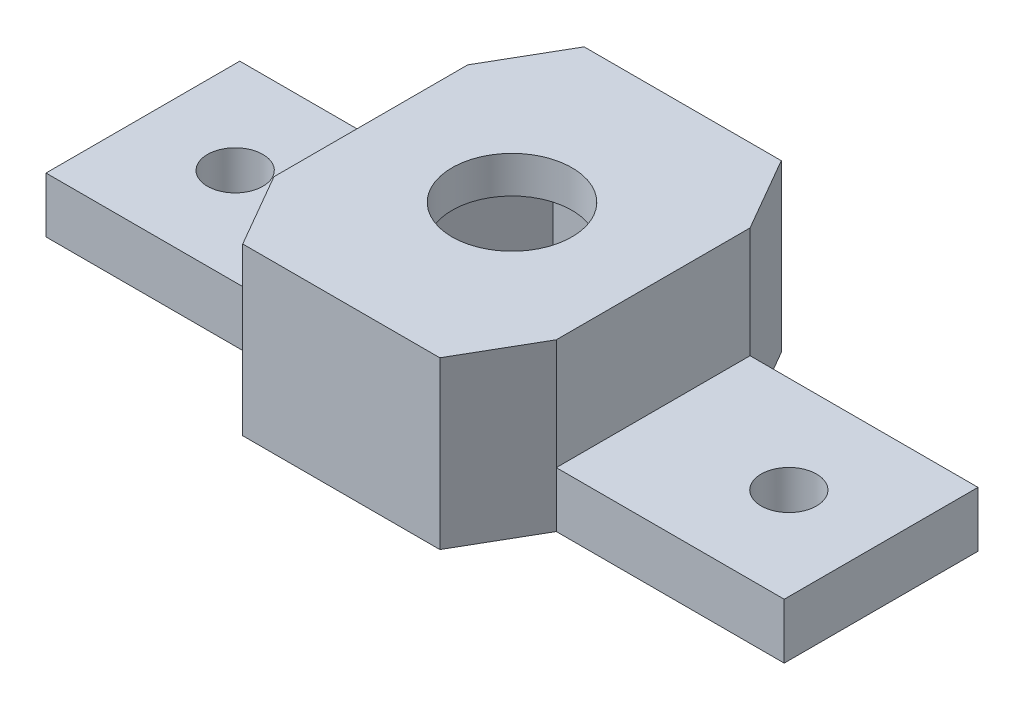
ISO-10303-21;
HEADER;
FILE_DESCRIPTION(('STEP AP214'),'2;1');
FILE_NAME('part.step','',(''),(''),'','','');
FILE_SCHEMA(('AUTOMOTIVE_DESIGN { 1 0 10303 214 1 1 1 1 }'));
ENDSEC;
DATA;
#1=APPLICATION_CONTEXT('core data for automotive mechanical design processes');
#2=APPLICATION_PROTOCOL_DEFINITION('international standard','automotive_design',2000,#1);
#3=PRODUCT_CONTEXT('',#1,'mechanical');
#4=PRODUCT('Part','Part','',(#3));
#5=PRODUCT_RELATED_PRODUCT_CATEGORY('part','',(#4));
#6=PRODUCT_DEFINITION_FORMATION('','',#4);
#7=PRODUCT_DEFINITION_CONTEXT('part definition',#1,'design');
#8=PRODUCT_DEFINITION('design','',#6,#7);
#9=PRODUCT_DEFINITION_SHAPE('','',#8);
#10=(LENGTH_UNIT() NAMED_UNIT(*) SI_UNIT(.MILLI.,.METRE.));
#11=(NAMED_UNIT(*) PLANE_ANGLE_UNIT() SI_UNIT($,.RADIAN.));
#12=(NAMED_UNIT(*) SI_UNIT($,.STERADIAN.) SOLID_ANGLE_UNIT());
#13=UNCERTAINTY_MEASURE_WITH_UNIT(LENGTH_MEASURE(1.E-05),#10,'distance_accuracy_value','');
#14=(GEOMETRIC_REPRESENTATION_CONTEXT(3) GLOBAL_UNCERTAINTY_ASSIGNED_CONTEXT((#13)) GLOBAL_UNIT_ASSIGNED_CONTEXT((#10,
#11,#12)) REPRESENTATION_CONTEXT('',''));
#15=CARTESIAN_POINT('',(0.,0.,0.));
#16=DIRECTION('',(0.,0.,1.));
#17=DIRECTION('',(1.,0.,0.));
#18=AXIS2_PLACEMENT_3D('',#15,#16,#17);
#19=CARTESIAN_POINT('',(5.34048999000404,0.,-9.25));
#20=DIRECTION('',(0.,1.,0.));
#21=DIRECTION('',(0.,0.,1.));
#22=AXIS2_PLACEMENT_3D('',#19,#20,#21);
#23=PLANE('',#22);
#24=CARTESIAN_POINT('',(-15.,0.,0.));
#25=DIRECTION('',(0.,1.,0.));
#26=DIRECTION('',(0.,0.,1.));
#27=AXIS2_PLACEMENT_3D('',#24,#25,#26);
#28=CIRCLE('',#27,1.5);
#29=CARTESIAN_POINT('',(-15.,0.,1.5));
#30=VERTEX_POINT('',#29);
#31=EDGE_CURVE('E242',#30,#30,#28,.T.);
#32=ORIENTED_EDGE('',*,*,#31,.T.);
#33=EDGE_LOOP('',(#32));
#34=FACE_BOUND('',#33,.T.);
#35=DIRECTION('',(-0.499999999999999,0.,-0.866025403784439));
#36=VECTOR('',#35,1.);
#37=CARTESIAN_POINT('',(7.64989106676253,0.,-5.25));
#38=LINE('',#37,#36);
#39=CARTESIAN_POINT('',(7.64989106676253,0.,-5.25));
#40=VERTEX_POINT('',#39);
#41=CARTESIAN_POINT('',(5.34048999000404,0.,-9.25));
#42=VERTEX_POINT('',#41);
#43=EDGE_CURVE('E295',#40,#42,#38,.T.);
#44=ORIENTED_EDGE('',*,*,#43,.F.);
#45=DIRECTION('',(-1.,0.,0.));
#46=VECTOR('',#45,1.);
#47=CARTESIAN_POINT('',(7.64989106676253,0.,-5.25));
#48=LINE('',#47,#46);
#49=CARTESIAN_POINT('',(20.,0.,-5.25));
#50=VERTEX_POINT('',#49);
#51=EDGE_CURVE('E324',#50,#40,#48,.T.);
#52=ORIENTED_EDGE('',*,*,#51,.F.);
#53=DIRECTION('',(0.,0.,-1.));
#54=VECTOR('',#53,1.);
#55=CARTESIAN_POINT('',(20.,0.,-5.25));
#56=LINE('',#55,#54);
#57=CARTESIAN_POINT('',(20.,0.,5.25));
#58=VERTEX_POINT('',#57);
#59=EDGE_CURVE('E321',#58,#50,#56,.T.);
#60=ORIENTED_EDGE('',*,*,#59,.F.);
#61=DIRECTION('',(1.,0.,0.));
#62=VECTOR('',#61,1.);
#63=CARTESIAN_POINT('',(20.,0.,5.25));
#64=LINE('',#63,#62);
#65=CARTESIAN_POINT('',(7.64989106676253,0.,5.25));
#66=VERTEX_POINT('',#65);
#67=EDGE_CURVE('E318',#66,#58,#64,.T.);
#68=ORIENTED_EDGE('',*,*,#67,.F.);
#69=DIRECTION('',(0.5,0.,-0.866025403784439));
#70=VECTOR('',#69,1.);
#71=CARTESIAN_POINT('',(5.34048999000403,0.,9.25));
#72=LINE('',#71,#70);
#73=CARTESIAN_POINT('',(5.34048999000403,0.,9.25));
#74=VERTEX_POINT('',#73);
#75=EDGE_CURVE('E315',#74,#66,#72,.T.);
#76=ORIENTED_EDGE('',*,*,#75,.F.);
#77=DIRECTION('',(1.,0.,0.));
#78=VECTOR('',#77,1.);
#79=CARTESIAN_POINT('',(-5.34048999000405,0.,9.25));
#80=LINE('',#79,#78);
#81=CARTESIAN_POINT('',(-5.34048999000405,0.,9.25));
#82=VERTEX_POINT('',#81);
#83=EDGE_CURVE('E313',#82,#74,#80,.T.);
#84=ORIENTED_EDGE('',*,*,#83,.F.);
#85=DIRECTION('',(0.5,0.,0.866025403784439));
#86=VECTOR('',#85,1.);
#87=CARTESIAN_POINT('',(-7.64989106676255,0.,5.25));
#88=LINE('',#87,#86);
#89=CARTESIAN_POINT('',(-7.64989106676255,0.,5.25));
#90=VERTEX_POINT('',#89);
#91=EDGE_CURVE('E177',#90,#82,#88,.T.);
#92=ORIENTED_EDGE('',*,*,#91,.F.);
#93=DIRECTION('',(1.,0.,0.));
#94=VECTOR('',#93,1.);
#95=CARTESIAN_POINT('',(-20.,0.,5.25));
#96=LINE('',#95,#94);
#97=CARTESIAN_POINT('',(-20.,0.,5.25));
#98=VERTEX_POINT('',#97);
#99=EDGE_CURVE('E309',#98,#90,#96,.T.);
#100=ORIENTED_EDGE('',*,*,#99,.F.);
#101=DIRECTION('',(0.,0.,1.));
#102=VECTOR('',#101,1.);
#103=CARTESIAN_POINT('',(-20.,0.,-5.25));
#104=LINE('',#103,#102);
#105=CARTESIAN_POINT('',(-20.,0.,-5.25));
#106=VERTEX_POINT('',#105);
#107=EDGE_CURVE('E306',#106,#98,#104,.T.);
#108=ORIENTED_EDGE('',*,*,#107,.F.);
#109=DIRECTION('',(-1.,0.,0.));
#110=VECTOR('',#109,1.);
#111=CARTESIAN_POINT('',(-7.64989106676255,0.,-5.25));
#112=LINE('',#111,#110);
#113=CARTESIAN_POINT('',(-7.64989106676255,0.,-5.25));
#114=VERTEX_POINT('',#113);
#115=EDGE_CURVE('E303',#114,#106,#112,.T.);
#116=ORIENTED_EDGE('',*,*,#115,.F.);
#117=DIRECTION('',(-0.499999999999999,0.,0.866025403784439));
#118=VECTOR('',#117,1.);
#119=CARTESIAN_POINT('',(-5.34048999000406,0.,-9.25));
#120=LINE('',#119,#118);
#121=CARTESIAN_POINT('',(-5.34048999000406,0.,-9.25));
#122=VERTEX_POINT('',#121);
#123=EDGE_CURVE('E300',#122,#114,#120,.T.);
#124=ORIENTED_EDGE('',*,*,#123,.F.);
#125=DIRECTION('',(-1.,0.,0.));
#126=VECTOR('',#125,1.);
#127=CARTESIAN_POINT('',(5.34048999000404,0.,-9.25));
#128=LINE('',#127,#126);
#129=EDGE_CURVE('E298',#42,#122,#128,.T.);
#130=ORIENTED_EDGE('',*,*,#129,.F.);
#131=EDGE_LOOP('',(#44,#52,#60,#68,#76,#84,#92,#100,#108,#116,#124,#130));
#132=FACE_BOUND('',#131,.T.);
#133=DIRECTION('',(0.5,0.,-0.866025403784439));
#134=VECTOR('',#133,1.);
#135=CARTESIAN_POINT('',(3.03108891324553,0.,5.25));
#136=LINE('',#135,#134);
#137=CARTESIAN_POINT('',(3.03108891324553,0.,5.25));
#138=VERTEX_POINT('',#137);
#139=CARTESIAN_POINT('',(6.06217782649106,0.,0.));
#140=VERTEX_POINT('',#139);
#141=EDGE_CURVE('E245',#138,#140,#136,.T.);
#142=ORIENTED_EDGE('',*,*,#141,.T.);
#143=DIRECTION('',(-0.5,0.,-0.866025403784438));
#144=VECTOR('',#143,1.);
#145=CARTESIAN_POINT('',(6.06217782649106,0.,0.));
#146=LINE('',#145,#144);
#147=CARTESIAN_POINT('',(3.03108891324553,0.,-5.25));
#148=VERTEX_POINT('',#147);
#149=EDGE_CURVE('E268',#140,#148,#146,.T.);
#150=ORIENTED_EDGE('',*,*,#149,.T.);
#151=DIRECTION('',(-1.,0.,0.));
#152=VECTOR('',#151,1.);
#153=CARTESIAN_POINT('',(3.03108891324553,0.,-5.25));
#154=LINE('',#153,#152);
#155=CARTESIAN_POINT('',(-3.03108891324555,0.,-5.25));
#156=VERTEX_POINT('',#155);
#157=EDGE_CURVE('E271',#148,#156,#154,.T.);
#158=ORIENTED_EDGE('',*,*,#157,.T.);
#159=DIRECTION('',(-0.5,0.,0.866025403784439));
#160=VECTOR('',#159,1.);
#161=CARTESIAN_POINT('',(-3.03108891324555,0.,-5.25));
#162=LINE('',#161,#160);
#163=CARTESIAN_POINT('',(-6.06217782649108,0.,0.));
#164=VERTEX_POINT('',#163);
#165=EDGE_CURVE('E274',#156,#164,#162,.T.);
#166=ORIENTED_EDGE('',*,*,#165,.T.);
#167=DIRECTION('',(0.499999999999999,0.,0.866025403784439));
#168=VECTOR('',#167,1.);
#169=CARTESIAN_POINT('',(-6.06217782649108,0.,0.));
#170=LINE('',#169,#168);
#171=CARTESIAN_POINT('',(-3.03108891324555,0.,5.25));
#172=VERTEX_POINT('',#171);
#173=EDGE_CURVE('E277',#164,#172,#170,.T.);
#174=ORIENTED_EDGE('',*,*,#173,.T.);
#175=DIRECTION('',(1.,0.,0.));
#176=VECTOR('',#175,1.);
#177=CARTESIAN_POINT('',(-3.03108891324555,0.,5.25));
#178=LINE('',#177,#176);
#179=EDGE_CURVE('E250',#172,#138,#178,.T.);
#180=ORIENTED_EDGE('',*,*,#179,.T.);
#181=EDGE_LOOP('',(#142,#150,#158,#166,#174,#180));
#182=FACE_BOUND('',#181,.T.);
#183=CARTESIAN_POINT('',(15.,0.,0.));
#184=DIRECTION('',(0.,1.,0.));
#185=DIRECTION('',(0.,0.,-1.));
#186=AXIS2_PLACEMENT_3D('',#183,#184,#185);
#187=CIRCLE('',#186,1.5);
#188=CARTESIAN_POINT('',(15.,0.,-1.5));
#189=VERTEX_POINT('',#188);
#190=EDGE_CURVE('E239',#189,#189,#187,.T.);
#191=ORIENTED_EDGE('',*,*,#190,.T.);
#192=EDGE_LOOP('',(#191));
#193=FACE_BOUND('',#192,.T.);
#194=ADVANCED_FACE('F33',(#34,#132,#182,#193),#23,.F.);
#195=CARTESIAN_POINT('',(7.64989106676253,7.,-5.25));
#196=DIRECTION('',(-0.866025403784439,0.,0.499999999999999));
#197=DIRECTION('',(0.499999999999999,0.,0.866025403784439));
#198=AXIS2_PLACEMENT_3D('',#195,#196,#197);
#199=PLANE('',#198);
#200=ORIENTED_EDGE('',*,*,#43,.T.);
#201=DIRECTION('',(0.,-1.,0.));
#202=VECTOR('',#201,1.);
#203=CARTESIAN_POINT('',(5.34048999000404,7.,-9.25));
#204=LINE('',#203,#202);
#205=CARTESIAN_POINT('',(5.34048999000404,9.,-9.25));
#206=VERTEX_POINT('',#205);
#207=EDGE_CURVE('E11',#206,#42,#204,.T.);
#208=ORIENTED_EDGE('',*,*,#207,.F.);
#209=DIRECTION('',(-0.499999999999999,0.,-0.866025403784439));
#210=VECTOR('',#209,1.);
#211=CARTESIAN_POINT('',(5.34048999000404,9.,-9.25));
#212=LINE('',#211,#210);
#213=CARTESIAN_POINT('',(7.64989106676253,9.,-5.25));
#214=VERTEX_POINT('',#213);
#215=EDGE_CURVE('E209',#214,#206,#212,.T.);
#216=ORIENTED_EDGE('',*,*,#215,.F.);
#217=DIRECTION('',(0.,-1.,0.));
#218=VECTOR('',#217,1.);
#219=CARTESIAN_POINT('',(7.64989106676253,7.,-5.25));
#220=LINE('',#219,#218);
#221=CARTESIAN_POINT('',(7.64989106676253,3.,-5.25));
#222=VERTEX_POINT('',#221);
#223=EDGE_CURVE('E328',#214,#222,#220,.T.);
#224=ORIENTED_EDGE('',*,*,#223,.T.);
#225=EDGE_CURVE('E327',#222,#40,#220,.T.);
#226=ORIENTED_EDGE('',*,*,#225,.T.);
#227=EDGE_LOOP('',(#200,#208,#216,#224,#226));
#228=FACE_BOUND('',#227,.T.);
#229=ADVANCED_FACE('F35',(#228),#199,.F.);
#230=CARTESIAN_POINT('',(5.34048999000404,7.,-9.25));
#231=DIRECTION('',(0.,0.,1.));
#232=DIRECTION('',(1.,0.,0.));
#233=AXIS2_PLACEMENT_3D('',#230,#231,#232);
#234=PLANE('',#233);
#235=ORIENTED_EDGE('',*,*,#129,.T.);
#236=DIRECTION('',(0.,-1.,0.));
#237=VECTOR('',#236,1.);
#238=CARTESIAN_POINT('',(-5.34048999000406,7.,-9.25));
#239=LINE('',#238,#237);
#240=CARTESIAN_POINT('',(-5.34048999000406,9.,-9.25));
#241=VERTEX_POINT('',#240);
#242=EDGE_CURVE('E41',#241,#122,#239,.T.);
#243=ORIENTED_EDGE('',*,*,#242,.F.);
#244=DIRECTION('',(-1.,0.,0.));
#245=VECTOR('',#244,1.);
#246=CARTESIAN_POINT('',(-5.34048999000406,9.,-9.25));
#247=LINE('',#246,#245);
#248=EDGE_CURVE('E212',#206,#241,#247,.T.);
#249=ORIENTED_EDGE('',*,*,#248,.F.);
#250=ORIENTED_EDGE('',*,*,#207,.T.);
#251=EDGE_LOOP('',(#235,#243,#249,#250));
#252=FACE_BOUND('',#251,.T.);
#253=ADVANCED_FACE('F385',(#252),#234,.F.);
#254=CARTESIAN_POINT('',(-5.34048999000406,7.,-9.25));
#255=DIRECTION('',(0.866025403784439,0.,0.499999999999999));
#256=DIRECTION('',(0.499999999999999,0.,-0.866025403784439));
#257=AXIS2_PLACEMENT_3D('',#254,#255,#256);
#258=PLANE('',#257);
#259=ORIENTED_EDGE('',*,*,#123,.T.);
#260=DIRECTION('',(0.,-1.,0.));
#261=VECTOR('',#260,1.);
#262=CARTESIAN_POINT('',(-7.64989106676255,7.,-5.25));
#263=LINE('',#262,#261);
#264=CARTESIAN_POINT('',(-7.64989106676255,3.,-5.25));
#265=VERTEX_POINT('',#264);
#266=EDGE_CURVE('E346',#265,#114,#263,.T.);
#267=ORIENTED_EDGE('',*,*,#266,.F.);
#268=CARTESIAN_POINT('',(-7.64989106676255,9.,-5.25));
#269=VERTEX_POINT('',#268);
#270=EDGE_CURVE('E347',#269,#265,#263,.T.);
#271=ORIENTED_EDGE('',*,*,#270,.F.);
#272=DIRECTION('',(-0.5,0.,0.866025403784439));
#273=VECTOR('',#272,1.);
#274=CARTESIAN_POINT('',(-7.64989106676255,9.,-5.25));
#275=LINE('',#274,#273);
#276=EDGE_CURVE('E215',#241,#269,#275,.T.);
#277=ORIENTED_EDGE('',*,*,#276,.F.);
#278=ORIENTED_EDGE('',*,*,#242,.T.);
#279=EDGE_LOOP('',(#259,#267,#271,#277,#278));
#280=FACE_BOUND('',#279,.T.);
#281=ADVANCED_FACE('F353',(#280),#258,.F.);
#282=CARTESIAN_POINT('',(-7.64989106676255,7.,-5.25));
#283=DIRECTION('',(0.,0.,1.));
#284=DIRECTION('',(1.,0.,0.));
#285=AXIS2_PLACEMENT_3D('',#282,#283,#284);
#286=PLANE('',#285);
#287=DIRECTION('',(0.,-1.,0.));
#288=VECTOR('',#287,1.);
#289=CARTESIAN_POINT('',(-20.,7.,-5.25));
#290=LINE('',#289,#288);
#291=CARTESIAN_POINT('',(-20.,3.,-5.25));
#292=VERTEX_POINT('',#291);
#293=EDGE_CURVE('E344',#292,#106,#290,.T.);
#294=ORIENTED_EDGE('',*,*,#293,.F.);
#295=DIRECTION('',(-1.,0.,0.));
#296=VECTOR('',#295,1.);
#297=CARTESIAN_POINT('',(-20.,3.,-5.25));
#298=LINE('',#297,#296);
#299=EDGE_CURVE('E234',#265,#292,#298,.T.);
#300=ORIENTED_EDGE('',*,*,#299,.F.);
#301=ORIENTED_EDGE('',*,*,#266,.T.);
#302=ORIENTED_EDGE('',*,*,#115,.T.);
#303=EDGE_LOOP('',(#294,#300,#301,#302));
#304=FACE_BOUND('',#303,.T.);
#305=ADVANCED_FACE('F365',(#304),#286,.F.);
#306=CARTESIAN_POINT('',(-20.,7.,-5.25));
#307=DIRECTION('',(1.,0.,0.));
#308=DIRECTION('',(0.,0.,-1.));
#309=AXIS2_PLACEMENT_3D('',#306,#307,#308);
#310=PLANE('',#309);
#311=DIRECTION('',(0.,-1.,0.));
#312=VECTOR('',#311,1.);
#313=CARTESIAN_POINT('',(-20.,7.,5.25));
#314=LINE('',#313,#312);
#315=CARTESIAN_POINT('',(-20.,3.,5.25));
#316=VERTEX_POINT('',#315);
#317=EDGE_CURVE('E342',#316,#98,#314,.T.);
#318=ORIENTED_EDGE('',*,*,#317,.F.);
#319=DIRECTION('',(0.,0.,1.));
#320=VECTOR('',#319,1.);
#321=CARTESIAN_POINT('',(-20.,3.,-9.251));
#322=LINE('',#321,#320);
#323=EDGE_CURVE('E231',#292,#316,#322,.T.);
#324=ORIENTED_EDGE('',*,*,#323,.F.);
#325=ORIENTED_EDGE('',*,*,#293,.T.);
#326=ORIENTED_EDGE('',*,*,#107,.T.);
#327=EDGE_LOOP('',(#318,#324,#325,#326));
#328=FACE_BOUND('',#327,.T.);
#329=ADVANCED_FACE('F434',(#328),#310,.F.);
#330=CARTESIAN_POINT('',(-20.,7.,5.25));
#331=DIRECTION('',(0.,0.,-1.));
#332=DIRECTION('',(-1.,0.,0.));
#333=AXIS2_PLACEMENT_3D('',#330,#331,#332);
#334=PLANE('',#333);
#335=DIRECTION('',(0.,-1.,0.));
#336=VECTOR('',#335,1.);
#337=CARTESIAN_POINT('',(-7.64989106676255,7.,5.25));
#338=LINE('',#337,#336);
#339=CARTESIAN_POINT('',(-7.64989106676255,3.,5.25));
#340=VERTEX_POINT('',#339);
#341=EDGE_CURVE('E180',#340,#90,#338,.T.);
#342=ORIENTED_EDGE('',*,*,#341,.F.);
#343=DIRECTION('',(1.,0.,0.));
#344=VECTOR('',#343,1.);
#345=CARTESIAN_POINT('',(-20.,3.,5.25));
#346=LINE('',#345,#344);
#347=EDGE_CURVE('E56',#316,#340,#346,.T.);
#348=ORIENTED_EDGE('',*,*,#347,.F.);
#349=ORIENTED_EDGE('',*,*,#317,.T.);
#350=ORIENTED_EDGE('',*,*,#99,.T.);
#351=EDGE_LOOP('',(#342,#348,#349,#350));
#352=FACE_BOUND('',#351,.T.);
#353=ADVANCED_FACE('F371',(#352),#334,.F.);
#354=CARTESIAN_POINT('',(-7.64989106676255,7.,5.25));
#355=DIRECTION('',(0.866025403784438,0.,-0.5));
#356=DIRECTION('',(-0.5,0.,-0.866025403784439));
#357=AXIS2_PLACEMENT_3D('',#354,#355,#356);
#358=PLANE('',#357);
#359=ORIENTED_EDGE('',*,*,#91,.T.);
#360=DIRECTION('',(0.,-1.,0.));
#361=VECTOR('',#360,1.);
#362=CARTESIAN_POINT('',(-5.34048999000405,7.,9.25));
#363=LINE('',#362,#361);
#364=CARTESIAN_POINT('',(-5.34048999000405,9.,9.25));
#365=VERTEX_POINT('',#364);
#366=EDGE_CURVE('E170',#365,#82,#363,.T.);
#367=ORIENTED_EDGE('',*,*,#366,.F.);
#368=DIRECTION('',(0.5,0.,0.866025403784439));
#369=VECTOR('',#368,1.);
#370=CARTESIAN_POINT('',(-5.34048999000405,9.,9.25));
#371=LINE('',#370,#369);
#372=CARTESIAN_POINT('',(-7.64989106676255,9.,5.25));
#373=VERTEX_POINT('',#372);
#374=EDGE_CURVE('E175',#373,#365,#371,.T.);
#375=ORIENTED_EDGE('',*,*,#374,.F.);
#376=EDGE_CURVE('E340',#373,#340,#338,.T.);
#377=ORIENTED_EDGE('',*,*,#376,.T.);
#378=ORIENTED_EDGE('',*,*,#341,.T.);
#379=EDGE_LOOP('',(#359,#367,#375,#377,#378));
#380=FACE_BOUND('',#379,.T.);
#381=ADVANCED_FACE('F172',(#380),#358,.F.);
#382=CARTESIAN_POINT('',(-5.34048999000405,7.,9.25));
#383=DIRECTION('',(0.,0.,-1.));
#384=DIRECTION('',(-1.,0.,0.));
#385=AXIS2_PLACEMENT_3D('',#382,#383,#384);
#386=PLANE('',#385);
#387=ORIENTED_EDGE('',*,*,#83,.T.);
#388=DIRECTION('',(0.,-1.,0.));
#389=VECTOR('',#388,1.);
#390=CARTESIAN_POINT('',(5.34048999000403,7.,9.25));
#391=LINE('',#390,#389);
#392=CARTESIAN_POINT('',(5.34048999000403,9.,9.25));
#393=VERTEX_POINT('',#392);
#394=EDGE_CURVE('E181',#393,#74,#391,.T.);
#395=ORIENTED_EDGE('',*,*,#394,.F.);
#396=DIRECTION('',(1.,0.,0.));
#397=VECTOR('',#396,1.);
#398=CARTESIAN_POINT('',(5.34048999000403,9.,9.25));
#399=LINE('',#398,#397);
#400=EDGE_CURVE('E184',#365,#393,#399,.T.);
#401=ORIENTED_EDGE('',*,*,#400,.F.);
#402=ORIENTED_EDGE('',*,*,#366,.T.);
#403=EDGE_LOOP('',(#387,#395,#401,#402));
#404=FACE_BOUND('',#403,.T.);
#405=ADVANCED_FACE('F185',(#404),#386,.F.);
#406=CARTESIAN_POINT('',(5.34048999000403,7.,9.25));
#407=DIRECTION('',(-0.866025403784439,0.,-0.5));
#408=DIRECTION('',(-0.5,0.,0.866025403784439));
#409=AXIS2_PLACEMENT_3D('',#406,#407,#408);
#410=PLANE('',#409);
#411=ORIENTED_EDGE('',*,*,#75,.T.);
#412=DIRECTION('',(0.,-1.,0.));
#413=VECTOR('',#412,1.);
#414=CARTESIAN_POINT('',(7.64989106676253,7.,5.25));
#415=LINE('',#414,#413);
#416=CARTESIAN_POINT('',(7.64989106676255,3.,5.25));
#417=VERTEX_POINT('',#416);
#418=EDGE_CURVE('E335',#417,#66,#415,.T.);
#419=ORIENTED_EDGE('',*,*,#418,.F.);
#420=CARTESIAN_POINT('',(7.64989106676255,9.,5.25));
#421=VERTEX_POINT('',#420);
#422=EDGE_CURVE('E336',#421,#417,#415,.T.);
#423=ORIENTED_EDGE('',*,*,#422,.F.);
#424=DIRECTION('',(0.500000000000003,0.,-0.866025403784437));
#425=VECTOR('',#424,1.);
#426=CARTESIAN_POINT('',(7.64989106676255,9.,5.25));
#427=LINE('',#426,#425);
#428=EDGE_CURVE('E190',#393,#421,#427,.T.);
#429=ORIENTED_EDGE('',*,*,#428,.F.);
#430=ORIENTED_EDGE('',*,*,#394,.T.);
#431=EDGE_LOOP('',(#411,#419,#423,#429,#430));
#432=FACE_BOUND('',#431,.T.);
#433=ADVANCED_FACE('F376',(#432),#410,.F.);
#434=CARTESIAN_POINT('',(20.,7.,5.25));
#435=DIRECTION('',(0.,0.,-1.));
#436=DIRECTION('',(-1.,0.,0.));
#437=AXIS2_PLACEMENT_3D('',#434,#435,#436);
#438=PLANE('',#437);
#439=DIRECTION('',(0.,-1.,0.));
#440=VECTOR('',#439,1.);
#441=CARTESIAN_POINT('',(20.,7.,5.25));
#442=LINE('',#441,#440);
#443=CARTESIAN_POINT('',(20.,3.00000000000018,5.25));
#444=VERTEX_POINT('',#443);
#445=EDGE_CURVE('E333',#444,#58,#442,.T.);
#446=ORIENTED_EDGE('',*,*,#445,.F.);
#447=DIRECTION('',(1.,0.,0.));
#448=VECTOR('',#447,1.);
#449=CARTESIAN_POINT('',(20.,3.00000000000018,5.25));
#450=LINE('',#449,#448);
#451=EDGE_CURVE('E220',#417,#444,#450,.T.);
#452=ORIENTED_EDGE('',*,*,#451,.F.);
#453=ORIENTED_EDGE('',*,*,#418,.T.);
#454=ORIENTED_EDGE('',*,*,#67,.T.);
#455=EDGE_LOOP('',(#446,#452,#453,#454));
#456=FACE_BOUND('',#455,.T.);
#457=ADVANCED_FACE('F395',(#456),#438,.F.);
#458=CARTESIAN_POINT('',(20.,7.,-5.25));
#459=DIRECTION('',(-1.,0.,0.));
#460=DIRECTION('',(0.,0.,1.));
#461=AXIS2_PLACEMENT_3D('',#458,#459,#460);
#462=PLANE('',#461);
#463=DIRECTION('',(0.,-1.,0.));
#464=VECTOR('',#463,1.);
#465=CARTESIAN_POINT('',(20.,7.,-5.25));
#466=LINE('',#465,#464);
#467=CARTESIAN_POINT('',(20.,3.00000000000018,-5.25));
#468=VERTEX_POINT('',#467);
#469=EDGE_CURVE('E331',#468,#50,#466,.T.);
#470=ORIENTED_EDGE('',*,*,#469,.F.);
#471=DIRECTION('',(0.,0.,1.));
#472=VECTOR('',#471,1.);
#473=CARTESIAN_POINT('',(20.,3.00000000000018,-9.251));
#474=LINE('',#473,#472);
#475=EDGE_CURVE('E223',#468,#444,#474,.T.);
#476=ORIENTED_EDGE('',*,*,#475,.T.);
#477=ORIENTED_EDGE('',*,*,#445,.T.);
#478=ORIENTED_EDGE('',*,*,#59,.T.);
#479=EDGE_LOOP('',(#470,#476,#477,#478));
#480=FACE_BOUND('',#479,.T.);
#481=ADVANCED_FACE('F392',(#480),#462,.F.);
#482=CARTESIAN_POINT('',(7.64989106676253,7.,-5.25));
#483=DIRECTION('',(0.,0.,1.));
#484=DIRECTION('',(1.,0.,0.));
#485=AXIS2_PLACEMENT_3D('',#482,#483,#484);
#486=PLANE('',#485);
#487=ORIENTED_EDGE('',*,*,#225,.F.);
#488=DIRECTION('',(-1.,0.,0.));
#489=VECTOR('',#488,1.);
#490=CARTESIAN_POINT('',(20.,3.00000000000018,-5.25));
#491=LINE('',#490,#489);
#492=EDGE_CURVE('E48',#468,#222,#491,.T.);
#493=ORIENTED_EDGE('',*,*,#492,.F.);
#494=ORIENTED_EDGE('',*,*,#469,.T.);
#495=ORIENTED_EDGE('',*,*,#51,.T.);
#496=EDGE_LOOP('',(#487,#493,#494,#495));
#497=FACE_BOUND('',#496,.T.);
#498=ADVANCED_FACE('F389',(#497),#486,.F.);
#499=CARTESIAN_POINT('',(3.03108891324553,7.,5.25));
#500=DIRECTION('',(-0.866025403784439,0.,-0.5));
#501=DIRECTION('',(-0.5,0.,0.866025403784439));
#502=AXIS2_PLACEMENT_3D('',#499,#500,#501);
#503=PLANE('',#502);
#504=ORIENTED_EDGE('',*,*,#141,.F.);
#505=DIRECTION('',(0.,-1.,0.));
#506=VECTOR('',#505,1.);
#507=CARTESIAN_POINT('',(3.03108891324553,7.,5.25));
#508=LINE('',#507,#506);
#509=CARTESIAN_POINT('',(3.03108891324553,7.,5.25));
#510=VERTEX_POINT('',#509);
#511=EDGE_CURVE('E265',#510,#138,#508,.T.);
#512=ORIENTED_EDGE('',*,*,#511,.F.);
#513=DIRECTION('',(0.5,0.,-0.866025403784439));
#514=VECTOR('',#513,1.);
#515=CARTESIAN_POINT('',(3.03108891324553,7.,5.25));
#516=LINE('',#515,#514);
#517=CARTESIAN_POINT('',(6.06217782649106,7.,0.));
#518=VERTEX_POINT('',#517);
#519=EDGE_CURVE('E246',#510,#518,#516,.T.);
#520=ORIENTED_EDGE('',*,*,#519,.T.);
#521=DIRECTION('',(0.,-1.,0.));
#522=VECTOR('',#521,1.);
#523=CARTESIAN_POINT('',(6.06217782649106,7.,0.));
#524=LINE('',#523,#522);
#525=EDGE_CURVE('E292',#518,#140,#524,.T.);
#526=ORIENTED_EDGE('',*,*,#525,.T.);
#527=EDGE_LOOP('',(#504,#512,#520,#526));
#528=FACE_BOUND('',#527,.T.);
#529=ADVANCED_FACE('F418',(#528),#503,.T.);
#530=CARTESIAN_POINT('',(6.06217782649106,7.,0.));
#531=DIRECTION('',(-0.866025403784438,0.,0.5));
#532=DIRECTION('',(0.5,0.,0.866025403784439));
#533=AXIS2_PLACEMENT_3D('',#530,#531,#532);
#534=PLANE('',#533);
#535=ORIENTED_EDGE('',*,*,#149,.F.);
#536=ORIENTED_EDGE('',*,*,#525,.F.);
#537=DIRECTION('',(-0.5,0.,-0.866025403784438));
#538=VECTOR('',#537,1.);
#539=CARTESIAN_POINT('',(6.06217782649106,7.,0.));
#540=LINE('',#539,#538);
#541=CARTESIAN_POINT('',(3.03108891324553,7.,-5.25));
#542=VERTEX_POINT('',#541);
#543=EDGE_CURVE('E249',#518,#542,#540,.T.);
#544=ORIENTED_EDGE('',*,*,#543,.T.);
#545=DIRECTION('',(0.,-1.,0.));
#546=VECTOR('',#545,1.);
#547=CARTESIAN_POINT('',(3.03108891324553,7.,-5.25));
#548=LINE('',#547,#546);
#549=EDGE_CURVE('E290',#542,#148,#548,.T.);
#550=ORIENTED_EDGE('',*,*,#549,.T.);
#551=EDGE_LOOP('',(#535,#536,#544,#550));
#552=FACE_BOUND('',#551,.T.);
#553=ADVANCED_FACE('F493',(#552),#534,.T.);
#554=CARTESIAN_POINT('',(3.03108891324553,7.,-5.25));
#555=DIRECTION('',(0.,0.,1.));
#556=DIRECTION('',(1.,0.,0.));
#557=AXIS2_PLACEMENT_3D('',#554,#555,#556);
#558=PLANE('',#557);
#559=ORIENTED_EDGE('',*,*,#157,.F.);
#560=ORIENTED_EDGE('',*,*,#549,.F.);
#561=DIRECTION('',(-1.,0.,0.));
#562=VECTOR('',#561,1.);
#563=CARTESIAN_POINT('',(3.03108891324553,7.,-5.25));
#564=LINE('',#563,#562);
#565=CARTESIAN_POINT('',(-3.03108891324555,7.,-5.25));
#566=VERTEX_POINT('',#565);
#567=EDGE_CURVE('E253',#542,#566,#564,.T.);
#568=ORIENTED_EDGE('',*,*,#567,.T.);
#569=DIRECTION('',(0.,-1.,0.));
#570=VECTOR('',#569,1.);
#571=CARTESIAN_POINT('',(-3.03108891324555,7.,-5.25));
#572=LINE('',#571,#570);
#573=EDGE_CURVE('E288',#566,#156,#572,.T.);
#574=ORIENTED_EDGE('',*,*,#573,.T.);
#575=EDGE_LOOP('',(#559,#560,#568,#574));
#576=FACE_BOUND('',#575,.T.);
#577=ADVANCED_FACE('F500',(#576),#558,.T.);
#578=CARTESIAN_POINT('',(-3.03108891324555,7.,-5.25));
#579=DIRECTION('',(0.866025403784439,0.,0.5));
#580=DIRECTION('',(0.5,0.,-0.866025403784439));
#581=AXIS2_PLACEMENT_3D('',#578,#579,#580);
#582=PLANE('',#581);
#583=ORIENTED_EDGE('',*,*,#165,.F.);
#584=ORIENTED_EDGE('',*,*,#573,.F.);
#585=DIRECTION('',(-0.5,0.,0.866025403784439));
#586=VECTOR('',#585,1.);
#587=CARTESIAN_POINT('',(-3.03108891324555,7.,-5.25));
#588=LINE('',#587,#586);
#589=CARTESIAN_POINT('',(-6.06217782649108,7.,0.));
#590=VERTEX_POINT('',#589);
#591=EDGE_CURVE('E256',#566,#590,#588,.T.);
#592=ORIENTED_EDGE('',*,*,#591,.T.);
#593=DIRECTION('',(0.,-1.,0.));
#594=VECTOR('',#593,1.);
#595=CARTESIAN_POINT('',(-6.06217782649108,7.,0.));
#596=LINE('',#595,#594);
#597=EDGE_CURVE('E286',#590,#164,#596,.T.);
#598=ORIENTED_EDGE('',*,*,#597,.T.);
#599=EDGE_LOOP('',(#583,#584,#592,#598));
#600=FACE_BOUND('',#599,.T.);
#601=ADVANCED_FACE('F507',(#600),#582,.T.);
#602=CARTESIAN_POINT('',(-6.06217782649108,7.,0.));
#603=DIRECTION('',(0.866025403784439,0.,-0.499999999999999));
#604=DIRECTION('',(-0.5,0.,-0.866025403784439));
#605=AXIS2_PLACEMENT_3D('',#602,#603,#604);
#606=PLANE('',#605);
#607=ORIENTED_EDGE('',*,*,#173,.F.);
#608=ORIENTED_EDGE('',*,*,#597,.F.);
#609=DIRECTION('',(0.499999999999999,0.,0.866025403784439));
#610=VECTOR('',#609,1.);
#611=CARTESIAN_POINT('',(-6.06217782649108,7.,0.));
#612=LINE('',#611,#610);
#613=CARTESIAN_POINT('',(-3.03108891324555,7.,5.25));
#614=VERTEX_POINT('',#613);
#615=EDGE_CURVE('E259',#590,#614,#612,.T.);
#616=ORIENTED_EDGE('',*,*,#615,.T.);
#617=DIRECTION('',(0.,-1.,0.));
#618=VECTOR('',#617,1.);
#619=CARTESIAN_POINT('',(-3.03108891324555,7.,5.25));
#620=LINE('',#619,#618);
#621=EDGE_CURVE('E284',#614,#172,#620,.T.);
#622=ORIENTED_EDGE('',*,*,#621,.T.);
#623=EDGE_LOOP('',(#607,#608,#616,#622));
#624=FACE_BOUND('',#623,.T.);
#625=ADVANCED_FACE('F515',(#624),#606,.T.);
#626=CARTESIAN_POINT('',(-3.03108891324555,7.,5.25));
#627=DIRECTION('',(0.,0.,-1.));
#628=DIRECTION('',(-1.,0.,0.));
#629=AXIS2_PLACEMENT_3D('',#626,#627,#628);
#630=PLANE('',#629);
#631=ORIENTED_EDGE('',*,*,#179,.F.);
#632=ORIENTED_EDGE('',*,*,#621,.F.);
#633=DIRECTION('',(1.,0.,0.));
#634=VECTOR('',#633,1.);
#635=CARTESIAN_POINT('',(-3.03108891324555,7.,5.25));
#636=LINE('',#635,#634);
#637=EDGE_CURVE('E262',#614,#510,#636,.T.);
#638=ORIENTED_EDGE('',*,*,#637,.T.);
#639=ORIENTED_EDGE('',*,*,#511,.T.);
#640=EDGE_LOOP('',(#631,#632,#638,#639));
#641=FACE_BOUND('',#640,.T.);
#642=ADVANCED_FACE('F523',(#641),#630,.T.);
#643=CARTESIAN_POINT('',(-15.,7.,0.));
#644=DIRECTION('',(0.,-1.,0.));
#645=DIRECTION('',(0.,0.,-1.));
#646=AXIS2_PLACEMENT_3D('',#643,#644,#645);
#647=CYLINDRICAL_SURFACE('',#646,1.5);
#648=CARTESIAN_POINT('',(-15.,3.,0.));
#649=DIRECTION('',(0.,-1.,0.));
#650=DIRECTION('',(0.,0.,-1.));
#651=AXIS2_PLACEMENT_3D('',#648,#649,#650);
#652=CIRCLE('',#651,1.5);
#653=CARTESIAN_POINT('',(-15.,3.,-1.5));
#654=VERTEX_POINT('',#653);
#655=EDGE_CURVE('E226',#654,#654,#652,.F.);
#656=ORIENTED_EDGE('',*,*,#655,.T.);
#657=EDGE_LOOP('',(#656));
#658=FACE_BOUND('',#657,.T.);
#659=ORIENTED_EDGE('',*,*,#31,.F.);
#660=EDGE_LOOP('',(#659));
#661=FACE_BOUND('',#660,.T.);
#662=ADVANCED_FACE('F531',(#658,#661),#647,.F.);
#663=CARTESIAN_POINT('',(15.,7.,0.));
#664=DIRECTION('',(0.,-1.,0.));
#665=DIRECTION('',(0.,0.,-1.));
#666=AXIS2_PLACEMENT_3D('',#663,#664,#665);
#667=CYLINDRICAL_SURFACE('',#666,1.5);
#668=CARTESIAN_POINT('',(15.,3.00000000000011,0.));
#669=DIRECTION('',(0.,-1.,0.));
#670=DIRECTION('',(1.,0.,0.));
#671=AXIS2_PLACEMENT_3D('',#668,#669,#670);
#672=CIRCLE('',#671,1.5);
#673=CARTESIAN_POINT('',(16.5,3.00000000000013,0.));
#674=VERTEX_POINT('',#673);
#675=EDGE_CURVE('E219',#674,#674,#672,.F.);
#676=ORIENTED_EDGE('',*,*,#675,.T.);
#677=EDGE_LOOP('',(#676));
#678=FACE_BOUND('',#677,.T.);
#679=ORIENTED_EDGE('',*,*,#190,.F.);
#680=EDGE_LOOP('',(#679));
#681=FACE_BOUND('',#680,.T.);
#682=ADVANCED_FACE('F539',(#678,#681),#667,.F.);
#683=CARTESIAN_POINT('',(-7.64989106676255,7.,-9.251));
#684=DIRECTION('',(1.,0.,0.));
#685=DIRECTION('',(0.,0.,-1.));
#686=AXIS2_PLACEMENT_3D('',#683,#684,#685);
#687=PLANE('',#686);
#688=ORIENTED_EDGE('',*,*,#270,.T.);
#689=DIRECTION('',(0.,0.,1.));
#690=VECTOR('',#689,1.);
#691=CARTESIAN_POINT('',(-7.64989106676255,3.,-9.251));
#692=LINE('',#691,#690);
#693=EDGE_CURVE('E232',#265,#340,#692,.T.);
#694=ORIENTED_EDGE('',*,*,#693,.T.);
#695=ORIENTED_EDGE('',*,*,#376,.F.);
#696=DIRECTION('',(0.,0.,1.));
#697=VECTOR('',#696,1.);
#698=CARTESIAN_POINT('',(-7.64989106676255,9.,5.25));
#699=LINE('',#698,#697);
#700=EDGE_CURVE('E197',#269,#373,#699,.T.);
#701=ORIENTED_EDGE('',*,*,#700,.F.);
#702=EDGE_LOOP('',(#688,#694,#695,#701));
#703=FACE_BOUND('',#702,.T.);
#704=ADVANCED_FACE('F368',(#703),#687,.F.);
#705=CARTESIAN_POINT('',(-20.,3.,-9.251));
#706=DIRECTION('',(0.,-1.,0.));
#707=DIRECTION('',(0.,0.,-1.));
#708=AXIS2_PLACEMENT_3D('',#705,#706,#707);
#709=PLANE('',#708);
#710=ORIENTED_EDGE('',*,*,#655,.F.);
#711=EDGE_LOOP('',(#710));
#712=FACE_BOUND('',#711,.T.);
#713=ORIENTED_EDGE('',*,*,#299,.T.);
#714=ORIENTED_EDGE('',*,*,#323,.T.);
#715=ORIENTED_EDGE('',*,*,#347,.T.);
#716=ORIENTED_EDGE('',*,*,#693,.F.);
#717=EDGE_LOOP('',(#713,#714,#715,#716));
#718=FACE_BOUND('',#717,.T.);
#719=ADVANCED_FACE('F398',(#712,#718),#709,.F.);
#720=CARTESIAN_POINT('',(20.,3.00000000000018,-9.251));
#721=DIRECTION('',(0.,-1.,0.));
#722=DIRECTION('',(1.,0.,0.));
#723=AXIS2_PLACEMENT_3D('',#720,#721,#722);
#724=PLANE('',#723);
#725=ORIENTED_EDGE('',*,*,#675,.F.);
#726=EDGE_LOOP('',(#725));
#727=FACE_BOUND('',#726,.T.);
#728=ORIENTED_EDGE('',*,*,#492,.T.);
#729=DIRECTION('',(0.,0.,1.));
#730=VECTOR('',#729,1.);
#731=CARTESIAN_POINT('',(7.64989106676255,3.,-9.251));
#732=LINE('',#731,#730);
#733=EDGE_CURVE('E222',#222,#417,#732,.T.);
#734=ORIENTED_EDGE('',*,*,#733,.T.);
#735=ORIENTED_EDGE('',*,*,#451,.T.);
#736=ORIENTED_EDGE('',*,*,#475,.F.);
#737=EDGE_LOOP('',(#728,#734,#735,#736));
#738=FACE_BOUND('',#737,.T.);
#739=ADVANCED_FACE('F396',(#727,#738),#724,.F.);
#740=CARTESIAN_POINT('',(7.64989106676255,7.,-9.251));
#741=DIRECTION('',(-1.,0.,0.));
#742=DIRECTION('',(0.,0.,1.));
#743=AXIS2_PLACEMENT_3D('',#740,#741,#742);
#744=PLANE('',#743);
#745=ORIENTED_EDGE('',*,*,#223,.F.);
#746=DIRECTION('',(0.,0.,-1.));
#747=VECTOR('',#746,1.);
#748=CARTESIAN_POINT('',(7.64989106676253,9.,-5.25));
#749=LINE('',#748,#747);
#750=EDGE_CURVE('E206',#421,#214,#749,.T.);
#751=ORIENTED_EDGE('',*,*,#750,.F.);
#752=ORIENTED_EDGE('',*,*,#422,.T.);
#753=ORIENTED_EDGE('',*,*,#733,.F.);
#754=EDGE_LOOP('',(#745,#751,#752,#753));
#755=FACE_BOUND('',#754,.T.);
#756=ADVANCED_FACE('F381',(#755),#744,.F.);
#757=CARTESIAN_POINT('',(-10.6809799800081,9.,0.));
#758=DIRECTION('',(0.,-1.,0.));
#759=DIRECTION('',(0.,0.,-1.));
#760=AXIS2_PLACEMENT_3D('',#757,#758,#759);
#761=PLANE('',#760);
#762=ORIENTED_EDGE('',*,*,#374,.T.);
#763=ORIENTED_EDGE('',*,*,#400,.T.);
#764=ORIENTED_EDGE('',*,*,#428,.T.);
#765=ORIENTED_EDGE('',*,*,#750,.T.);
#766=ORIENTED_EDGE('',*,*,#215,.T.);
#767=ORIENTED_EDGE('',*,*,#248,.T.);
#768=ORIENTED_EDGE('',*,*,#276,.T.);
#769=ORIENTED_EDGE('',*,*,#700,.T.);
#770=EDGE_LOOP('',(#762,#763,#764,#765,#766,#767,#768,#769));
#771=FACE_BOUND('',#770,.T.);
#772=CARTESIAN_POINT('',(0.,9.,0.));
#773=DIRECTION('',(0.,1.,0.));
#774=DIRECTION('',(0.,0.,1.));
#775=AXIS2_PLACEMENT_3D('',#772,#773,#774);
#776=CIRCLE('',#775,3.25);
#777=CARTESIAN_POINT('',(0.,9.,3.25));
#778=VERTEX_POINT('',#777);
#779=EDGE_CURVE('E198',#778,#778,#776,.T.);
#780=ORIENTED_EDGE('',*,*,#779,.F.);
#781=EDGE_LOOP('',(#780));
#782=FACE_BOUND('',#781,.T.);
#783=ADVANCED_FACE('F193',(#771,#782),#761,.F.);
#784=CARTESIAN_POINT('',(-10.6809799800081,7.,0.));
#785=DIRECTION('',(0.,-1.,0.));
#786=DIRECTION('',(0.,0.,-1.));
#787=AXIS2_PLACEMENT_3D('',#784,#785,#786);
#788=PLANE('',#787);
#789=ORIENTED_EDGE('',*,*,#543,.F.);
#790=ORIENTED_EDGE('',*,*,#519,.F.);
#791=ORIENTED_EDGE('',*,*,#637,.F.);
#792=ORIENTED_EDGE('',*,*,#615,.F.);
#793=ORIENTED_EDGE('',*,*,#591,.F.);
#794=ORIENTED_EDGE('',*,*,#567,.F.);
#795=EDGE_LOOP('',(#789,#790,#791,#792,#793,#794));
#796=FACE_BOUND('',#795,.T.);
#797=CARTESIAN_POINT('',(0.,7.,0.));
#798=DIRECTION('',(0.,1.,0.));
#799=DIRECTION('',(0.,0.,1.));
#800=AXIS2_PLACEMENT_3D('',#797,#798,#799);
#801=CIRCLE('',#800,3.25);
#802=CARTESIAN_POINT('',(0.,7.,3.25));
#803=VERTEX_POINT('',#802);
#804=EDGE_CURVE('E201',#803,#803,#801,.T.);
#805=ORIENTED_EDGE('',*,*,#804,.T.);
#806=EDGE_LOOP('',(#805));
#807=FACE_BOUND('',#806,.T.);
#808=ADVANCED_FACE('F617',(#796,#807),#788,.T.);
#809=CARTESIAN_POINT('',(0.,9.,0.));
#810=DIRECTION('',(0.,-1.,0.));
#811=DIRECTION('',(0.,0.,-1.));
#812=AXIS2_PLACEMENT_3D('',#809,#810,#811);
#813=CYLINDRICAL_SURFACE('',#812,3.25);
#814=ORIENTED_EDGE('',*,*,#779,.T.);
#815=EDGE_LOOP('',(#814));
#816=FACE_BOUND('',#815,.T.);
#817=ORIENTED_EDGE('',*,*,#804,.F.);
#818=EDGE_LOOP('',(#817));
#819=FACE_BOUND('',#818,.T.);
#820=ADVANCED_FACE('F625',(#816,#819),#813,.F.);
#821=CLOSED_SHELL('',(#194,#229,#253,#281,#305,#329,#353,#381,#405,#433,#457,#481,#498,#529,
#553,#577,#601,#625,#642,#662,#682,#704,#719,#739,#756,#783,#808,#820));
#822=MANIFOLD_SOLID_BREP('B2',#821);
#823=ADVANCED_BREP_SHAPE_REPRESENTATION('',(#18,#822),#14);
#824=SHAPE_DEFINITION_REPRESENTATION(#9,#823);
ENDSEC;
END-ISO-10303-21;
